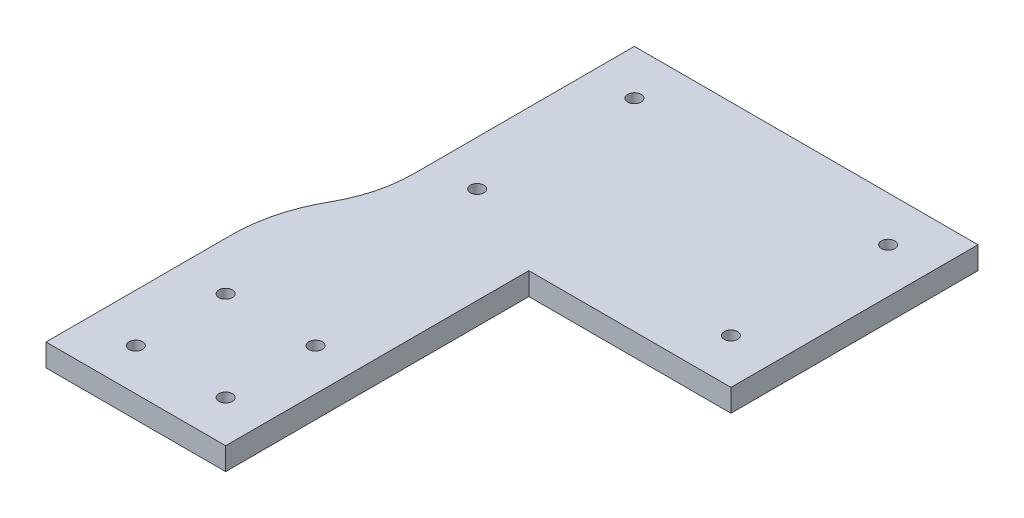
ISO-10303-21;
HEADER;
FILE_DESCRIPTION(('STEP AP214'),'2;1');
FILE_NAME('part.step','',(''),(''),'','','');
FILE_SCHEMA(('AUTOMOTIVE_DESIGN { 1 0 10303 214 1 1 1 1 }'));
ENDSEC;
DATA;
#1=APPLICATION_CONTEXT('core data for automotive mechanical design processes');
#2=APPLICATION_PROTOCOL_DEFINITION('international standard','automotive_design',2000,#1);
#3=PRODUCT_CONTEXT('',#1,'mechanical');
#4=PRODUCT('Part','Part','',(#3));
#5=PRODUCT_RELATED_PRODUCT_CATEGORY('part','',(#4));
#6=PRODUCT_DEFINITION_FORMATION('','',#4);
#7=PRODUCT_DEFINITION_CONTEXT('part definition',#1,'design');
#8=PRODUCT_DEFINITION('design','',#6,#7);
#9=PRODUCT_DEFINITION_SHAPE('','',#8);
#10=(LENGTH_UNIT() NAMED_UNIT(*) SI_UNIT(.MILLI.,.METRE.));
#11=(NAMED_UNIT(*) PLANE_ANGLE_UNIT() SI_UNIT($,.RADIAN.));
#12=(NAMED_UNIT(*) SI_UNIT($,.STERADIAN.) SOLID_ANGLE_UNIT());
#13=UNCERTAINTY_MEASURE_WITH_UNIT(LENGTH_MEASURE(1.E-05),#10,'distance_accuracy_value','');
#14=(GEOMETRIC_REPRESENTATION_CONTEXT(3) GLOBAL_UNCERTAINTY_ASSIGNED_CONTEXT((#13)) GLOBAL_UNIT_ASSIGNED_CONTEXT((#10,
#11,#12)) REPRESENTATION_CONTEXT('',''));
#15=CARTESIAN_POINT('',(0.,0.,0.));
#16=DIRECTION('',(0.,0.,1.));
#17=DIRECTION('',(1.,0.,0.));
#18=AXIS2_PLACEMENT_3D('',#15,#16,#17);
#19=CARTESIAN_POINT('',(0.,10.,0.));
#20=DIRECTION('',(0.,-1.,0.));
#21=DIRECTION('',(0.,0.,-1.));
#22=AXIS2_PLACEMENT_3D('',#19,#20,#21);
#23=PLANE('',#22);
#24=CARTESIAN_POINT('',(42.,10.,-26.8449519058153));
#25=DIRECTION('',(0.,-1.,0.));
#26=DIRECTION('',(0.,0.,-1.));
#27=AXIS2_PLACEMENT_3D('',#24,#25,#26);
#28=CIRCLE('',#27,60.);
#29=CARTESIAN_POINT('',(102.,10.,-26.8449519058153));
#30=VERTEX_POINT('',#29);
#31=CARTESIAN_POINT('',(94.1538461538462,10.,2.81944310505493));
#32=VERTEX_POINT('',#31);
#33=EDGE_CURVE('E150',#30,#32,#28,.T.);
#34=ORIENTED_EDGE('',*,*,#33,.T.);
#35=CARTESIAN_POINT('',(155.,10.,37.4279039510703));
#36=DIRECTION('',(0.,-1.,0.));
#37=DIRECTION('',(0.,0.,-1.));
#38=AXIS2_PLACEMENT_3D('',#35,#36,#37);
#39=CIRCLE('',#38,70.);
#40=CARTESIAN_POINT('',(85.,10.,37.4279039510703));
#41=VERTEX_POINT('',#40);
#42=EDGE_CURVE('E11',#32,#41,#39,.F.);
#43=ORIENTED_EDGE('',*,*,#42,.T.);
#44=DIRECTION('',(0.,0.,1.));
#45=VECTOR('',#44,1.);
#46=CARTESIAN_POINT('',(85.,10.,120.));
#47=LINE('',#46,#45);
#48=CARTESIAN_POINT('',(85.,10.,120.));
#49=VERTEX_POINT('',#48);
#50=EDGE_CURVE('E166',#41,#49,#47,.T.);
#51=ORIENTED_EDGE('',*,*,#50,.T.);
#52=DIRECTION('',(1.,0.,0.));
#53=VECTOR('',#52,1.);
#54=CARTESIAN_POINT('',(165.,10.,120.));
#55=LINE('',#54,#53);
#56=CARTESIAN_POINT('',(165.,10.,120.));
#57=VERTEX_POINT('',#56);
#58=EDGE_CURVE('E127',#49,#57,#55,.T.);
#59=ORIENTED_EDGE('',*,*,#58,.T.);
#60=DIRECTION('',(0.,0.,-1.));
#61=VECTOR('',#60,1.);
#62=CARTESIAN_POINT('',(165.,10.,120.));
#63=LINE('',#62,#61);
#64=CARTESIAN_POINT('',(165.,10.,-15.));
#65=VERTEX_POINT('',#64);
#66=EDGE_CURVE('E122',#57,#65,#63,.T.);
#67=ORIENTED_EDGE('',*,*,#66,.T.);
#68=DIRECTION('',(1.,0.,0.));
#69=VECTOR('',#68,1.);
#70=CARTESIAN_POINT('',(165.,10.,-15.));
#71=LINE('',#70,#69);
#72=CARTESIAN_POINT('',(255.,10.,-15.));
#73=VERTEX_POINT('',#72);
#74=EDGE_CURVE('E110',#65,#73,#71,.T.);
#75=ORIENTED_EDGE('',*,*,#74,.T.);
#76=DIRECTION('',(0.,0.,-1.));
#77=VECTOR('',#76,1.);
#78=CARTESIAN_POINT('',(255.,10.,-15.));
#79=LINE('',#78,#77);
#80=CARTESIAN_POINT('',(255.,10.,-125.));
#81=VERTEX_POINT('',#80);
#82=EDGE_CURVE('E121',#73,#81,#79,.T.);
#83=ORIENTED_EDGE('',*,*,#82,.T.);
#84=DIRECTION('',(-1.,0.,0.));
#85=VECTOR('',#84,1.);
#86=CARTESIAN_POINT('',(102.,10.,-125.));
#87=LINE('',#86,#85);
#88=CARTESIAN_POINT('',(102.,10.,-125.));
#89=VERTEX_POINT('',#88);
#90=EDGE_CURVE('E200',#81,#89,#87,.T.);
#91=ORIENTED_EDGE('',*,*,#90,.T.);
#92=DIRECTION('',(0.,0.,1.));
#93=VECTOR('',#92,1.);
#94=CARTESIAN_POINT('',(102.,10.,15.));
#95=LINE('',#94,#93);
#96=EDGE_CURVE('E219',#89,#30,#95,.T.);
#97=ORIENTED_EDGE('',*,*,#96,.T.);
#98=EDGE_LOOP('',(#34,#43,#51,#59,#67,#75,#83,#91,#97));
#99=FACE_BOUND('',#98,.T.);
#100=CARTESIAN_POINT('',(146.4,10.,101.4));
#101=DIRECTION('',(0.,1.,0.));
#102=DIRECTION('',(0.,0.,1.));
#103=AXIS2_PLACEMENT_3D('',#100,#101,#102);
#104=CIRCLE('',#103,2.99999999999999);
#105=CARTESIAN_POINT('',(146.4,10.,104.4));
#106=VERTEX_POINT('',#105);
#107=EDGE_CURVE('E214',#106,#106,#104,.T.);
#108=ORIENTED_EDGE('',*,*,#107,.F.);
#109=EDGE_LOOP('',(#108));
#110=FACE_BOUND('',#109,.T.);
#111=CARTESIAN_POINT('',(106.4,10.,101.4));
#112=DIRECTION('',(0.,1.,0.));
#113=DIRECTION('',(0.,0.,1.));
#114=AXIS2_PLACEMENT_3D('',#111,#112,#113);
#115=CIRCLE('',#114,3.00000000000001);
#116=CARTESIAN_POINT('',(106.4,10.,104.4));
#117=VERTEX_POINT('',#116);
#118=EDGE_CURVE('E231',#117,#117,#115,.T.);
#119=ORIENTED_EDGE('',*,*,#118,.F.);
#120=EDGE_LOOP('',(#119));
#121=FACE_BOUND('',#120,.T.);
#122=CARTESIAN_POINT('',(146.4,10.,61.4));
#123=DIRECTION('',(0.,1.,0.));
#124=DIRECTION('',(0.,0.,1.));
#125=AXIS2_PLACEMENT_3D('',#122,#123,#124);
#126=CIRCLE('',#125,2.99999999999999);
#127=CARTESIAN_POINT('',(146.4,10.,64.4));
#128=VERTEX_POINT('',#127);
#129=EDGE_CURVE('E239',#128,#128,#126,.T.);
#130=ORIENTED_EDGE('',*,*,#129,.F.);
#131=EDGE_LOOP('',(#130));
#132=FACE_BOUND('',#131,.T.);
#133=CARTESIAN_POINT('',(106.4,10.,61.4));
#134=DIRECTION('',(0.,1.,0.));
#135=DIRECTION('',(0.,0.,1.));
#136=AXIS2_PLACEMENT_3D('',#133,#134,#135);
#137=CIRCLE('',#136,3.00000000000001);
#138=CARTESIAN_POINT('',(106.4,10.,64.4));
#139=VERTEX_POINT('',#138);
#140=EDGE_CURVE('E247',#139,#139,#137,.T.);
#141=ORIENTED_EDGE('',*,*,#140,.F.);
#142=EDGE_LOOP('',(#141));
#143=FACE_BOUND('',#142,.T.);
#144=CARTESIAN_POINT('',(235.,10.,-35.));
#145=DIRECTION('',(0.,1.,0.));
#146=DIRECTION('',(0.,0.,1.));
#147=AXIS2_PLACEMENT_3D('',#144,#145,#146);
#148=CIRCLE('',#147,2.99999999999999);
#149=CARTESIAN_POINT('',(235.,10.,-32.));
#150=VERTEX_POINT('',#149);
#151=EDGE_CURVE('E255',#150,#150,#148,.T.);
#152=ORIENTED_EDGE('',*,*,#151,.F.);
#153=EDGE_LOOP('',(#152));
#154=FACE_BOUND('',#153,.T.);
#155=CARTESIAN_POINT('',(235.,10.,-105.));
#156=DIRECTION('',(0.,1.,0.));
#157=DIRECTION('',(0.,0.,1.));
#158=AXIS2_PLACEMENT_3D('',#155,#156,#157);
#159=CIRCLE('',#158,2.99999999999999);
#160=CARTESIAN_POINT('',(235.,10.,-102.));
#161=VERTEX_POINT('',#160);
#162=EDGE_CURVE('E263',#161,#161,#159,.T.);
#163=ORIENTED_EDGE('',*,*,#162,.F.);
#164=EDGE_LOOP('',(#163));
#165=FACE_BOUND('',#164,.T.);
#166=CARTESIAN_POINT('',(122.,10.,-105.));
#167=DIRECTION('',(0.,1.,0.));
#168=DIRECTION('',(0.,0.,1.));
#169=AXIS2_PLACEMENT_3D('',#166,#167,#168);
#170=CIRCLE('',#169,3.00000000000001);
#171=CARTESIAN_POINT('',(122.,10.,-102.));
#172=VERTEX_POINT('',#171);
#173=EDGE_CURVE('E271',#172,#172,#170,.T.);
#174=ORIENTED_EDGE('',*,*,#173,.F.);
#175=EDGE_LOOP('',(#174));
#176=FACE_BOUND('',#175,.T.);
#177=CARTESIAN_POINT('',(122.,10.,-35.));
#178=DIRECTION('',(0.,1.,0.));
#179=DIRECTION('',(0.,0.,1.));
#180=AXIS2_PLACEMENT_3D('',#177,#178,#179);
#181=CIRCLE('',#180,3.00000000000001);
#182=CARTESIAN_POINT('',(122.,10.,-32.));
#183=VERTEX_POINT('',#182);
#184=EDGE_CURVE('E279',#183,#183,#181,.T.);
#185=ORIENTED_EDGE('',*,*,#184,.F.);
#186=EDGE_LOOP('',(#185));
#187=FACE_BOUND('',#186,.T.);
#188=ADVANCED_FACE('F39',(#99,#110,#121,#132,#143,#154,#165,#176,#187),#23,.F.);
#189=CARTESIAN_POINT('',(0.,0.,0.));
#190=DIRECTION('',(0.,-1.,0.));
#191=DIRECTION('',(0.,0.,-1.));
#192=AXIS2_PLACEMENT_3D('',#189,#190,#191);
#193=PLANE('',#192);
#194=CARTESIAN_POINT('',(122.,0.,-105.));
#195=DIRECTION('',(0.,1.,0.));
#196=DIRECTION('',(0.,0.,1.));
#197=AXIS2_PLACEMENT_3D('',#194,#195,#196);
#198=CIRCLE('',#197,3.00000000000001);
#199=CARTESIAN_POINT('',(122.,0.,-102.));
#200=VERTEX_POINT('',#199);
#201=EDGE_CURVE('E275',#200,#200,#198,.T.);
#202=ORIENTED_EDGE('',*,*,#201,.T.);
#203=EDGE_LOOP('',(#202));
#204=FACE_BOUND('',#203,.T.);
#205=CARTESIAN_POINT('',(235.,0.,-35.));
#206=DIRECTION('',(0.,1.,0.));
#207=DIRECTION('',(0.,0.,1.));
#208=AXIS2_PLACEMENT_3D('',#205,#206,#207);
#209=CIRCLE('',#208,2.99999999999999);
#210=CARTESIAN_POINT('',(235.,0.,-32.));
#211=VERTEX_POINT('',#210);
#212=EDGE_CURVE('E259',#211,#211,#209,.T.);
#213=ORIENTED_EDGE('',*,*,#212,.T.);
#214=EDGE_LOOP('',(#213));
#215=FACE_BOUND('',#214,.T.);
#216=CARTESIAN_POINT('',(146.4,0.,61.4));
#217=DIRECTION('',(0.,1.,0.));
#218=DIRECTION('',(0.,0.,1.));
#219=AXIS2_PLACEMENT_3D('',#216,#217,#218);
#220=CIRCLE('',#219,2.99999999999999);
#221=CARTESIAN_POINT('',(146.4,0.,64.4));
#222=VERTEX_POINT('',#221);
#223=EDGE_CURVE('E243',#222,#222,#220,.T.);
#224=ORIENTED_EDGE('',*,*,#223,.T.);
#225=EDGE_LOOP('',(#224));
#226=FACE_BOUND('',#225,.T.);
#227=CARTESIAN_POINT('',(146.4,0.,101.4));
#228=DIRECTION('',(0.,1.,0.));
#229=DIRECTION('',(0.,0.,1.));
#230=AXIS2_PLACEMENT_3D('',#227,#228,#229);
#231=CIRCLE('',#230,2.99999999999999);
#232=CARTESIAN_POINT('',(146.4,0.,104.4));
#233=VERTEX_POINT('',#232);
#234=EDGE_CURVE('E227',#233,#233,#231,.T.);
#235=ORIENTED_EDGE('',*,*,#234,.T.);
#236=EDGE_LOOP('',(#235));
#237=FACE_BOUND('',#236,.T.);
#238=DIRECTION('',(0.,0.,1.));
#239=VECTOR('',#238,1.);
#240=CARTESIAN_POINT('',(85.,0.,120.));
#241=LINE('',#240,#239);
#242=CARTESIAN_POINT('',(85.,0.,37.4279039510703));
#243=VERTEX_POINT('',#242);
#244=CARTESIAN_POINT('',(85.,0.,120.));
#245=VERTEX_POINT('',#244);
#246=EDGE_CURVE('E164',#243,#245,#241,.T.);
#247=ORIENTED_EDGE('',*,*,#246,.F.);
#248=CARTESIAN_POINT('',(155.,0.,37.4279039510703));
#249=DIRECTION('',(0.,-1.,0.));
#250=DIRECTION('',(0.,0.,-1.));
#251=AXIS2_PLACEMENT_3D('',#248,#249,#250);
#252=CIRCLE('',#251,70.);
#253=CARTESIAN_POINT('',(94.1538461538462,0.,2.81944310505493));
#254=VERTEX_POINT('',#253);
#255=EDGE_CURVE('E62',#243,#254,#252,.T.);
#256=ORIENTED_EDGE('',*,*,#255,.T.);
#257=CARTESIAN_POINT('',(42.,0.,-26.8449519058153));
#258=DIRECTION('',(0.,-1.,0.));
#259=DIRECTION('',(0.,0.,-1.));
#260=AXIS2_PLACEMENT_3D('',#257,#258,#259);
#261=CIRCLE('',#260,60.);
#262=CARTESIAN_POINT('',(102.,0.,-26.8449519058153));
#263=VERTEX_POINT('',#262);
#264=EDGE_CURVE('E142',#254,#263,#261,.F.);
#265=ORIENTED_EDGE('',*,*,#264,.T.);
#266=DIRECTION('',(0.,0.,1.));
#267=VECTOR('',#266,1.);
#268=CARTESIAN_POINT('',(102.,0.,15.));
#269=LINE('',#268,#267);
#270=CARTESIAN_POINT('',(102.,0.,-125.));
#271=VERTEX_POINT('',#270);
#272=EDGE_CURVE('E173',#271,#263,#269,.T.);
#273=ORIENTED_EDGE('',*,*,#272,.F.);
#274=DIRECTION('',(-1.,0.,0.));
#275=VECTOR('',#274,1.);
#276=CARTESIAN_POINT('',(102.,0.,-125.));
#277=LINE('',#276,#275);
#278=CARTESIAN_POINT('',(255.,0.,-125.));
#279=VERTEX_POINT('',#278);
#280=EDGE_CURVE('E179',#279,#271,#277,.T.);
#281=ORIENTED_EDGE('',*,*,#280,.F.);
#282=DIRECTION('',(0.,0.,-1.));
#283=VECTOR('',#282,1.);
#284=CARTESIAN_POINT('',(255.,0.,-15.));
#285=LINE('',#284,#283);
#286=CARTESIAN_POINT('',(255.,0.,-15.));
#287=VERTEX_POINT('',#286);
#288=EDGE_CURVE('E204',#287,#279,#285,.T.);
#289=ORIENTED_EDGE('',*,*,#288,.F.);
#290=DIRECTION('',(1.,0.,0.));
#291=VECTOR('',#290,1.);
#292=CARTESIAN_POINT('',(165.,0.,-15.));
#293=LINE('',#292,#291);
#294=CARTESIAN_POINT('',(165.,0.,-15.));
#295=VERTEX_POINT('',#294);
#296=EDGE_CURVE('E207',#295,#287,#293,.T.);
#297=ORIENTED_EDGE('',*,*,#296,.F.);
#298=DIRECTION('',(0.,0.,-1.));
#299=VECTOR('',#298,1.);
#300=CARTESIAN_POINT('',(165.,0.,120.));
#301=LINE('',#300,#299);
#302=CARTESIAN_POINT('',(165.,0.,120.));
#303=VERTEX_POINT('',#302);
#304=EDGE_CURVE('E136',#303,#295,#301,.T.);
#305=ORIENTED_EDGE('',*,*,#304,.F.);
#306=DIRECTION('',(1.,0.,0.));
#307=VECTOR('',#306,1.);
#308=CARTESIAN_POINT('',(165.,0.,120.));
#309=LINE('',#308,#307);
#310=EDGE_CURVE('E132',#245,#303,#309,.T.);
#311=ORIENTED_EDGE('',*,*,#310,.F.);
#312=EDGE_LOOP('',(#247,#256,#265,#273,#281,#289,#297,#305,#311));
#313=FACE_BOUND('',#312,.T.);
#314=CARTESIAN_POINT('',(106.4,0.,101.4));
#315=DIRECTION('',(0.,1.,0.));
#316=DIRECTION('',(0.,0.,1.));
#317=AXIS2_PLACEMENT_3D('',#314,#315,#316);
#318=CIRCLE('',#317,3.00000000000001);
#319=CARTESIAN_POINT('',(106.4,0.,104.4));
#320=VERTEX_POINT('',#319);
#321=EDGE_CURVE('E235',#320,#320,#318,.T.);
#322=ORIENTED_EDGE('',*,*,#321,.T.);
#323=EDGE_LOOP('',(#322));
#324=FACE_BOUND('',#323,.T.);
#325=CARTESIAN_POINT('',(106.4,0.,61.4));
#326=DIRECTION('',(0.,1.,0.));
#327=DIRECTION('',(0.,0.,1.));
#328=AXIS2_PLACEMENT_3D('',#325,#326,#327);
#329=CIRCLE('',#328,3.00000000000001);
#330=CARTESIAN_POINT('',(106.4,0.,64.4));
#331=VERTEX_POINT('',#330);
#332=EDGE_CURVE('E251',#331,#331,#329,.T.);
#333=ORIENTED_EDGE('',*,*,#332,.T.);
#334=EDGE_LOOP('',(#333));
#335=FACE_BOUND('',#334,.T.);
#336=CARTESIAN_POINT('',(235.,0.,-105.));
#337=DIRECTION('',(0.,1.,0.));
#338=DIRECTION('',(0.,0.,1.));
#339=AXIS2_PLACEMENT_3D('',#336,#337,#338);
#340=CIRCLE('',#339,2.99999999999999);
#341=CARTESIAN_POINT('',(235.,0.,-102.));
#342=VERTEX_POINT('',#341);
#343=EDGE_CURVE('E267',#342,#342,#340,.T.);
#344=ORIENTED_EDGE('',*,*,#343,.T.);
#345=EDGE_LOOP('',(#344));
#346=FACE_BOUND('',#345,.T.);
#347=CARTESIAN_POINT('',(122.,0.,-35.));
#348=DIRECTION('',(0.,1.,0.));
#349=DIRECTION('',(0.,0.,1.));
#350=AXIS2_PLACEMENT_3D('',#347,#348,#349);
#351=CIRCLE('',#350,3.00000000000001);
#352=CARTESIAN_POINT('',(122.,0.,-32.));
#353=VERTEX_POINT('',#352);
#354=EDGE_CURVE('E283',#353,#353,#351,.T.);
#355=ORIENTED_EDGE('',*,*,#354,.T.);
#356=EDGE_LOOP('',(#355));
#357=FACE_BOUND('',#356,.T.);
#358=ADVANCED_FACE('F170',(#204,#215,#226,#237,#313,#324,#335,#346,#357),#193,.T.);
#359=CARTESIAN_POINT('',(165.,10.,120.));
#360=DIRECTION('',(-1.,0.,0.));
#361=DIRECTION('',(0.,0.,1.));
#362=AXIS2_PLACEMENT_3D('',#359,#360,#361);
#363=PLANE('',#362);
#364=ORIENTED_EDGE('',*,*,#304,.T.);
#365=DIRECTION('',(0.,-1.,0.));
#366=VECTOR('',#365,1.);
#367=CARTESIAN_POINT('',(165.,10.,-15.));
#368=LINE('',#367,#366);
#369=EDGE_CURVE('E114',#65,#295,#368,.T.);
#370=ORIENTED_EDGE('',*,*,#369,.F.);
#371=ORIENTED_EDGE('',*,*,#66,.F.);
#372=DIRECTION('',(0.,-1.,0.));
#373=VECTOR('',#372,1.);
#374=CARTESIAN_POINT('',(165.,10.,120.));
#375=LINE('',#374,#373);
#376=EDGE_CURVE('E183',#57,#303,#375,.T.);
#377=ORIENTED_EDGE('',*,*,#376,.T.);
#378=EDGE_LOOP('',(#364,#370,#371,#377));
#379=FACE_BOUND('',#378,.T.);
#380=ADVANCED_FACE('F134',(#379),#363,.F.);
#381=CARTESIAN_POINT('',(165.,10.,-15.));
#382=DIRECTION('',(0.,0.,-1.));
#383=DIRECTION('',(-1.,0.,0.));
#384=AXIS2_PLACEMENT_3D('',#381,#382,#383);
#385=PLANE('',#384);
#386=ORIENTED_EDGE('',*,*,#296,.T.);
#387=DIRECTION('',(0.,-1.,0.));
#388=VECTOR('',#387,1.);
#389=CARTESIAN_POINT('',(255.,10.,-15.));
#390=LINE('',#389,#388);
#391=EDGE_CURVE('E117',#73,#287,#390,.T.);
#392=ORIENTED_EDGE('',*,*,#391,.F.);
#393=ORIENTED_EDGE('',*,*,#74,.F.);
#394=ORIENTED_EDGE('',*,*,#369,.T.);
#395=EDGE_LOOP('',(#386,#392,#393,#394));
#396=FACE_BOUND('',#395,.T.);
#397=ADVANCED_FACE('F112',(#396),#385,.F.);
#398=CARTESIAN_POINT('',(255.,10.,-15.));
#399=DIRECTION('',(-1.,0.,0.));
#400=DIRECTION('',(0.,0.,1.));
#401=AXIS2_PLACEMENT_3D('',#398,#399,#400);
#402=PLANE('',#401);
#403=ORIENTED_EDGE('',*,*,#288,.T.);
#404=DIRECTION('',(0.,-1.,0.));
#405=VECTOR('',#404,1.);
#406=CARTESIAN_POINT('',(255.,10.,-125.));
#407=LINE('',#406,#405);
#408=EDGE_CURVE('E144',#81,#279,#407,.T.);
#409=ORIENTED_EDGE('',*,*,#408,.F.);
#410=ORIENTED_EDGE('',*,*,#82,.F.);
#411=ORIENTED_EDGE('',*,*,#391,.T.);
#412=EDGE_LOOP('',(#403,#409,#410,#411));
#413=FACE_BOUND('',#412,.T.);
#414=ADVANCED_FACE('F317',(#413),#402,.F.);
#415=CARTESIAN_POINT('',(102.,10.,-125.));
#416=DIRECTION('',(0.,0.,1.));
#417=DIRECTION('',(1.,0.,0.));
#418=AXIS2_PLACEMENT_3D('',#415,#416,#417);
#419=PLANE('',#418);
#420=ORIENTED_EDGE('',*,*,#280,.T.);
#421=DIRECTION('',(0.,-1.,0.));
#422=VECTOR('',#421,1.);
#423=CARTESIAN_POINT('',(102.,10.,-125.));
#424=LINE('',#423,#422);
#425=EDGE_CURVE('E189',#89,#271,#424,.T.);
#426=ORIENTED_EDGE('',*,*,#425,.F.);
#427=ORIENTED_EDGE('',*,*,#90,.F.);
#428=ORIENTED_EDGE('',*,*,#408,.T.);
#429=EDGE_LOOP('',(#420,#426,#427,#428));
#430=FACE_BOUND('',#429,.T.);
#431=ADVANCED_FACE('F198',(#430),#419,.F.);
#432=CARTESIAN_POINT('',(102.,10.,15.));
#433=DIRECTION('',(1.,0.,0.));
#434=DIRECTION('',(0.,0.,-1.));
#435=AXIS2_PLACEMENT_3D('',#432,#433,#434);
#436=PLANE('',#435);
#437=ORIENTED_EDGE('',*,*,#272,.T.);
#438=DIRECTION('',(0.,1.,0.));
#439=VECTOR('',#438,1.);
#440=CARTESIAN_POINT('',(102.,10.,-26.8449519058153));
#441=LINE('',#440,#439);
#442=EDGE_CURVE('E138',#263,#30,#441,.T.);
#443=ORIENTED_EDGE('',*,*,#442,.T.);
#444=ORIENTED_EDGE('',*,*,#96,.F.);
#445=ORIENTED_EDGE('',*,*,#425,.T.);
#446=EDGE_LOOP('',(#437,#443,#444,#445));
#447=FACE_BOUND('',#446,.T.);
#448=ADVANCED_FACE('F311',(#447),#436,.F.);
#449=CARTESIAN_POINT('',(85.,10.,120.));
#450=DIRECTION('',(1.,0.,0.));
#451=DIRECTION('',(0.,0.,-1.));
#452=AXIS2_PLACEMENT_3D('',#449,#450,#451);
#453=PLANE('',#452);
#454=ORIENTED_EDGE('',*,*,#50,.F.);
#455=DIRECTION('',(0.,1.,0.));
#456=VECTOR('',#455,1.);
#457=CARTESIAN_POINT('',(85.,10.,37.4279039510703));
#458=LINE('',#457,#456);
#459=EDGE_CURVE('E153',#41,#243,#458,.F.);
#460=ORIENTED_EDGE('',*,*,#459,.T.);
#461=ORIENTED_EDGE('',*,*,#246,.T.);
#462=DIRECTION('',(0.,-1.,0.));
#463=VECTOR('',#462,1.);
#464=CARTESIAN_POINT('',(85.,10.,120.));
#465=LINE('',#464,#463);
#466=EDGE_CURVE('E186',#49,#245,#465,.T.);
#467=ORIENTED_EDGE('',*,*,#466,.F.);
#468=EDGE_LOOP('',(#454,#460,#461,#467));
#469=FACE_BOUND('',#468,.T.);
#470=ADVANCED_FACE('F162',(#469),#453,.F.);
#471=CARTESIAN_POINT('',(165.,10.,120.));
#472=DIRECTION('',(0.,0.,-1.));
#473=DIRECTION('',(-1.,0.,0.));
#474=AXIS2_PLACEMENT_3D('',#471,#472,#473);
#475=PLANE('',#474);
#476=ORIENTED_EDGE('',*,*,#310,.T.);
#477=ORIENTED_EDGE('',*,*,#376,.F.);
#478=ORIENTED_EDGE('',*,*,#58,.F.);
#479=ORIENTED_EDGE('',*,*,#466,.T.);
#480=EDGE_LOOP('',(#476,#477,#478,#479));
#481=FACE_BOUND('',#480,.T.);
#482=ADVANCED_FACE('F305',(#481),#475,.F.);
#483=CARTESIAN_POINT('',(146.4,10.,101.4));
#484=DIRECTION('',(0.,-1.,0.));
#485=DIRECTION('',(0.,0.,-1.));
#486=AXIS2_PLACEMENT_3D('',#483,#484,#485);
#487=CYLINDRICAL_SURFACE('',#486,2.99999999999999);
#488=ORIENTED_EDGE('',*,*,#107,.T.);
#489=EDGE_LOOP('',(#488));
#490=FACE_BOUND('',#489,.T.);
#491=ORIENTED_EDGE('',*,*,#234,.F.);
#492=EDGE_LOOP('',(#491));
#493=FACE_BOUND('',#492,.T.);
#494=ADVANCED_FACE('F302',(#490,#493),#487,.F.);
#495=CARTESIAN_POINT('',(106.4,10.,101.4));
#496=DIRECTION('',(0.,-1.,0.));
#497=DIRECTION('',(0.,0.,-1.));
#498=AXIS2_PLACEMENT_3D('',#495,#496,#497);
#499=CYLINDRICAL_SURFACE('',#498,3.00000000000001);
#500=ORIENTED_EDGE('',*,*,#118,.T.);
#501=EDGE_LOOP('',(#500));
#502=FACE_BOUND('',#501,.T.);
#503=ORIENTED_EDGE('',*,*,#321,.F.);
#504=EDGE_LOOP('',(#503));
#505=FACE_BOUND('',#504,.T.);
#506=ADVANCED_FACE('F353',(#502,#505),#499,.F.);
#507=CARTESIAN_POINT('',(146.4,10.,61.4));
#508=DIRECTION('',(0.,-1.,0.));
#509=DIRECTION('',(0.,0.,-1.));
#510=AXIS2_PLACEMENT_3D('',#507,#508,#509);
#511=CYLINDRICAL_SURFACE('',#510,2.99999999999999);
#512=ORIENTED_EDGE('',*,*,#129,.T.);
#513=EDGE_LOOP('',(#512));
#514=FACE_BOUND('',#513,.T.);
#515=ORIENTED_EDGE('',*,*,#223,.F.);
#516=EDGE_LOOP('',(#515));
#517=FACE_BOUND('',#516,.T.);
#518=ADVANCED_FACE('F350',(#514,#517),#511,.F.);
#519=CARTESIAN_POINT('',(106.4,10.,61.4));
#520=DIRECTION('',(0.,-1.,0.));
#521=DIRECTION('',(0.,0.,-1.));
#522=AXIS2_PLACEMENT_3D('',#519,#520,#521);
#523=CYLINDRICAL_SURFACE('',#522,3.00000000000001);
#524=ORIENTED_EDGE('',*,*,#140,.T.);
#525=EDGE_LOOP('',(#524));
#526=FACE_BOUND('',#525,.T.);
#527=ORIENTED_EDGE('',*,*,#332,.F.);
#528=EDGE_LOOP('',(#527));
#529=FACE_BOUND('',#528,.T.);
#530=ADVANCED_FACE('F346',(#526,#529),#523,.F.);
#531=CARTESIAN_POINT('',(235.,10.,-35.));
#532=DIRECTION('',(0.,-1.,0.));
#533=DIRECTION('',(0.,0.,-1.));
#534=AXIS2_PLACEMENT_3D('',#531,#532,#533);
#535=CYLINDRICAL_SURFACE('',#534,2.99999999999999);
#536=ORIENTED_EDGE('',*,*,#151,.T.);
#537=EDGE_LOOP('',(#536));
#538=FACE_BOUND('',#537,.T.);
#539=ORIENTED_EDGE('',*,*,#212,.F.);
#540=EDGE_LOOP('',(#539));
#541=FACE_BOUND('',#540,.T.);
#542=ADVANCED_FACE('F342',(#538,#541),#535,.F.);
#543=CARTESIAN_POINT('',(235.,10.,-105.));
#544=DIRECTION('',(0.,-1.,0.));
#545=DIRECTION('',(0.,0.,-1.));
#546=AXIS2_PLACEMENT_3D('',#543,#544,#545);
#547=CYLINDRICAL_SURFACE('',#546,2.99999999999999);
#548=ORIENTED_EDGE('',*,*,#162,.T.);
#549=EDGE_LOOP('',(#548));
#550=FACE_BOUND('',#549,.T.);
#551=ORIENTED_EDGE('',*,*,#343,.F.);
#552=EDGE_LOOP('',(#551));
#553=FACE_BOUND('',#552,.T.);
#554=ADVANCED_FACE('F336',(#550,#553),#547,.F.);
#555=CARTESIAN_POINT('',(122.,10.,-105.));
#556=DIRECTION('',(0.,-1.,0.));
#557=DIRECTION('',(0.,0.,-1.));
#558=AXIS2_PLACEMENT_3D('',#555,#556,#557);
#559=CYLINDRICAL_SURFACE('',#558,3.00000000000001);
#560=ORIENTED_EDGE('',*,*,#173,.T.);
#561=EDGE_LOOP('',(#560));
#562=FACE_BOUND('',#561,.T.);
#563=ORIENTED_EDGE('',*,*,#201,.F.);
#564=EDGE_LOOP('',(#563));
#565=FACE_BOUND('',#564,.T.);
#566=ADVANCED_FACE('F329',(#562,#565),#559,.F.);
#567=CARTESIAN_POINT('',(122.,10.,-35.));
#568=DIRECTION('',(0.,-1.,0.));
#569=DIRECTION('',(0.,0.,-1.));
#570=AXIS2_PLACEMENT_3D('',#567,#568,#569);
#571=CYLINDRICAL_SURFACE('',#570,3.00000000000001);
#572=ORIENTED_EDGE('',*,*,#184,.T.);
#573=EDGE_LOOP('',(#572));
#574=FACE_BOUND('',#573,.T.);
#575=ORIENTED_EDGE('',*,*,#354,.F.);
#576=EDGE_LOOP('',(#575));
#577=FACE_BOUND('',#576,.T.);
#578=ADVANCED_FACE('F291',(#574,#577),#571,.F.);
#579=CARTESIAN_POINT('',(42.,10.,-26.8449519058153));
#580=DIRECTION('',(0.,1.,0.));
#581=DIRECTION('',(0.,0.,1.));
#582=AXIS2_PLACEMENT_3D('',#579,#580,#581);
#583=CYLINDRICAL_SURFACE('',#582,60.);
#584=ORIENTED_EDGE('',*,*,#264,.F.);
#585=DIRECTION('',(0.,1.,0.));
#586=VECTOR('',#585,1.);
#587=CARTESIAN_POINT('',(94.1538461538462,10.,2.81944310505494));
#588=LINE('',#587,#586);
#589=EDGE_CURVE('E48',#254,#32,#588,.T.);
#590=ORIENTED_EDGE('',*,*,#589,.T.);
#591=ORIENTED_EDGE('',*,*,#33,.F.);
#592=ORIENTED_EDGE('',*,*,#442,.F.);
#593=EDGE_LOOP('',(#584,#590,#591,#592));
#594=FACE_BOUND('',#593,.T.);
#595=ADVANCED_FACE('F323',(#594),#583,.F.);
#596=CARTESIAN_POINT('',(155.,10.,37.4279039510703));
#597=DIRECTION('',(0.,1.,0.));
#598=DIRECTION('',(0.,0.,1.));
#599=AXIS2_PLACEMENT_3D('',#596,#597,#598);
#600=CYLINDRICAL_SURFACE('',#599,70.);
#601=ORIENTED_EDGE('',*,*,#42,.F.);
#602=ORIENTED_EDGE('',*,*,#589,.F.);
#603=ORIENTED_EDGE('',*,*,#255,.F.);
#604=ORIENTED_EDGE('',*,*,#459,.F.);
#605=EDGE_LOOP('',(#601,#602,#603,#604));
#606=FACE_BOUND('',#605,.T.);
#607=ADVANCED_FACE('F41',(#606),#600,.T.);
#608=CLOSED_SHELL('',(#188,#358,#380,#397,#414,#431,#448,#470,#482,#494,#506,#518,#530,#542,
#554,#566,#578,#595,#607));
#609=MANIFOLD_SOLID_BREP('B2',#608);
#610=ADVANCED_BREP_SHAPE_REPRESENTATION('',(#18,#609),#14);
#611=SHAPE_DEFINITION_REPRESENTATION(#9,#610);
ENDSEC;
END-ISO-10303-21;
